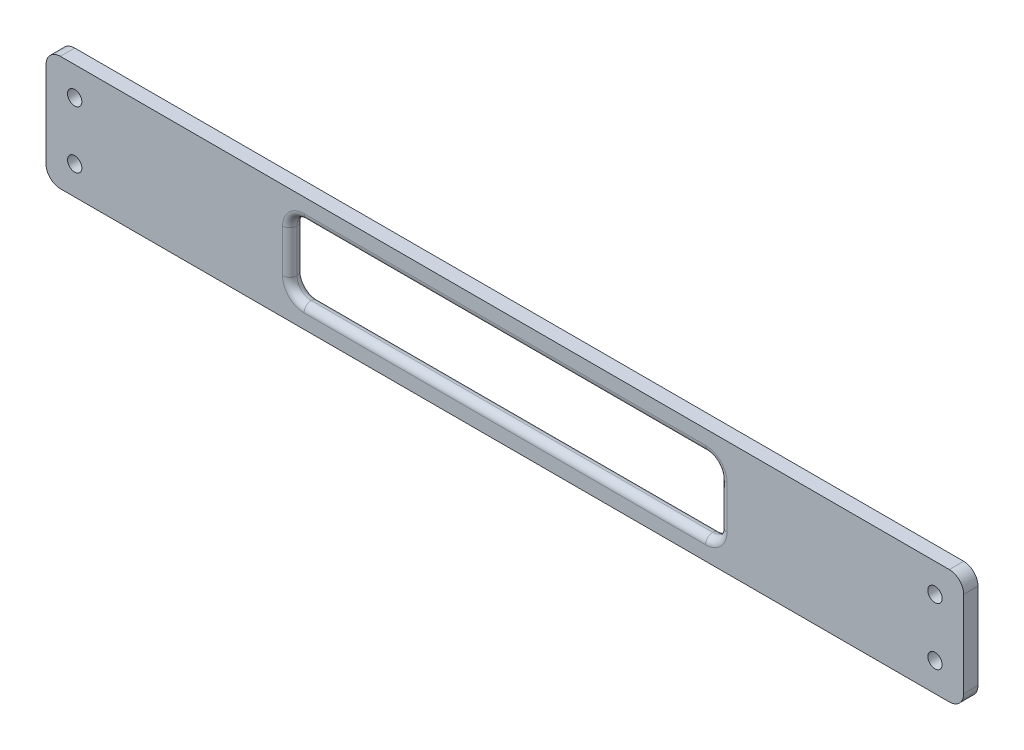
ISO-10303-21;
HEADER;
FILE_DESCRIPTION(('STEP AP214'),'2;1');
FILE_NAME('part.step','',(''),(''),'','','');
FILE_SCHEMA(('AUTOMOTIVE_DESIGN { 1 0 10303 214 1 1 1 1 }'));
ENDSEC;
DATA;
#1=APPLICATION_CONTEXT('core data for automotive mechanical design processes');
#2=APPLICATION_PROTOCOL_DEFINITION('international standard','automotive_design',2000,#1);
#3=PRODUCT_CONTEXT('',#1,'mechanical');
#4=PRODUCT('Part','Part','',(#3));
#5=PRODUCT_RELATED_PRODUCT_CATEGORY('part','',(#4));
#6=PRODUCT_DEFINITION_FORMATION('','',#4);
#7=PRODUCT_DEFINITION_CONTEXT('part definition',#1,'design');
#8=PRODUCT_DEFINITION('design','',#6,#7);
#9=PRODUCT_DEFINITION_SHAPE('','',#8);
#10=(LENGTH_UNIT() NAMED_UNIT(*) SI_UNIT(.MILLI.,.METRE.));
#11=(NAMED_UNIT(*) PLANE_ANGLE_UNIT() SI_UNIT($,.RADIAN.));
#12=(NAMED_UNIT(*) SI_UNIT($,.STERADIAN.) SOLID_ANGLE_UNIT());
#13=UNCERTAINTY_MEASURE_WITH_UNIT(LENGTH_MEASURE(1.E-05),#10,'distance_accuracy_value','');
#14=(GEOMETRIC_REPRESENTATION_CONTEXT(3) GLOBAL_UNCERTAINTY_ASSIGNED_CONTEXT((#13)) GLOBAL_UNIT_ASSIGNED_CONTEXT((#10,
#11,#12)) REPRESENTATION_CONTEXT('',''));
#15=CARTESIAN_POINT('',(0.,0.,0.));
#16=DIRECTION('',(0.,0.,1.));
#17=DIRECTION('',(1.,0.,0.));
#18=AXIS2_PLACEMENT_3D('',#15,#16,#17);
#19=CARTESIAN_POINT('',(203.2,-25.4,6.35));
#20=DIRECTION('',(-1.,0.,0.));
#21=DIRECTION('',(0.,0.,1.));
#22=AXIS2_PLACEMENT_3D('',#19,#20,#21);
#23=PLANE('',#22);
#24=DIRECTION('',(0.,1.,0.));
#25=VECTOR('',#24,1.);
#26=CARTESIAN_POINT('',(203.2,-25.4,6.35));
#27=LINE('',#26,#25);
#28=CARTESIAN_POINT('',(203.2,-19.05,6.35));
#29=VERTEX_POINT('',#28);
#30=CARTESIAN_POINT('',(203.2,19.05,6.35));
#31=VERTEX_POINT('',#30);
#32=EDGE_CURVE('E230',#29,#31,#27,.T.);
#33=ORIENTED_EDGE('',*,*,#32,.F.);
#34=DIRECTION('',(0.,0.,-1.));
#35=VECTOR('',#34,1.);
#36=CARTESIAN_POINT('',(203.2,-19.05,6.35));
#37=LINE('',#36,#35);
#38=CARTESIAN_POINT('',(203.2,-19.05,0.));
#39=VERTEX_POINT('',#38);
#40=EDGE_CURVE('E255',#29,#39,#37,.T.);
#41=ORIENTED_EDGE('',*,*,#40,.T.);
#42=DIRECTION('',(0.,1.,0.));
#43=VECTOR('',#42,1.);
#44=CARTESIAN_POINT('',(203.2,-25.4,0.));
#45=LINE('',#44,#43);
#46=CARTESIAN_POINT('',(203.2,19.05,0.));
#47=VERTEX_POINT('',#46);
#48=EDGE_CURVE('E225',#39,#47,#45,.T.);
#49=ORIENTED_EDGE('',*,*,#48,.T.);
#50=DIRECTION('',(0.,0.,-1.));
#51=VECTOR('',#50,1.);
#52=CARTESIAN_POINT('',(203.2,19.05,6.35));
#53=LINE('',#52,#51);
#54=EDGE_CURVE('E243',#47,#31,#53,.F.);
#55=ORIENTED_EDGE('',*,*,#54,.T.);
#56=EDGE_LOOP('',(#33,#41,#49,#55));
#57=FACE_BOUND('',#56,.T.);
#58=ADVANCED_FACE('F33',(#57),#23,.F.);
#59=CARTESIAN_POINT('',(-203.2,25.4,6.35));
#60=DIRECTION('',(0.,-1.,0.));
#61=DIRECTION('',(0.,0.,-1.));
#62=AXIS2_PLACEMENT_3D('',#59,#60,#61);
#63=PLANE('',#62);
#64=DIRECTION('',(-1.,0.,0.));
#65=VECTOR('',#64,1.);
#66=CARTESIAN_POINT('',(-203.2,25.4,6.35));
#67=LINE('',#66,#65);
#68=CARTESIAN_POINT('',(196.85,25.4,6.35));
#69=VERTEX_POINT('',#68);
#70=CARTESIAN_POINT('',(-196.85,25.4,6.35));
#71=VERTEX_POINT('',#70);
#72=EDGE_CURVE('E233',#69,#71,#67,.T.);
#73=ORIENTED_EDGE('',*,*,#72,.F.);
#74=DIRECTION('',(0.,0.,-1.));
#75=VECTOR('',#74,1.);
#76=CARTESIAN_POINT('',(196.85,25.4,6.35));
#77=LINE('',#76,#75);
#78=CARTESIAN_POINT('',(196.85,25.4,0.));
#79=VERTEX_POINT('',#78);
#80=EDGE_CURVE('E279',#69,#79,#77,.T.);
#81=ORIENTED_EDGE('',*,*,#80,.T.);
#82=DIRECTION('',(-1.,0.,0.));
#83=VECTOR('',#82,1.);
#84=CARTESIAN_POINT('',(-203.2,25.4,0.));
#85=LINE('',#84,#83);
#86=CARTESIAN_POINT('',(-196.85,25.4,0.));
#87=VERTEX_POINT('',#86);
#88=EDGE_CURVE('E246',#79,#87,#85,.T.);
#89=ORIENTED_EDGE('',*,*,#88,.T.);
#90=DIRECTION('',(0.,0.,-1.));
#91=VECTOR('',#90,1.);
#92=CARTESIAN_POINT('',(-196.85,25.4,6.35));
#93=LINE('',#92,#91);
#94=EDGE_CURVE('E277',#87,#71,#93,.F.);
#95=ORIENTED_EDGE('',*,*,#94,.T.);
#96=EDGE_LOOP('',(#73,#81,#89,#95));
#97=FACE_BOUND('',#96,.T.);
#98=ADVANCED_FACE('F389',(#97),#63,.F.);
#99=CARTESIAN_POINT('',(-203.2,-25.4,6.35));
#100=DIRECTION('',(1.,0.,0.));
#101=DIRECTION('',(0.,0.,-1.));
#102=AXIS2_PLACEMENT_3D('',#99,#100,#101);
#103=PLANE('',#102);
#104=DIRECTION('',(0.,-1.,0.));
#105=VECTOR('',#104,1.);
#106=CARTESIAN_POINT('',(-203.2,-25.4,0.));
#107=LINE('',#106,#105);
#108=CARTESIAN_POINT('',(-203.2,19.05,0.));
#109=VERTEX_POINT('',#108);
#110=CARTESIAN_POINT('',(-203.2,-19.05,0.));
#111=VERTEX_POINT('',#110);
#112=EDGE_CURVE('E249',#109,#111,#107,.T.);
#113=ORIENTED_EDGE('',*,*,#112,.T.);
#114=DIRECTION('',(0.,0.,-1.));
#115=VECTOR('',#114,1.);
#116=CARTESIAN_POINT('',(-203.2,-19.05,6.35));
#117=LINE('',#116,#115);
#118=CARTESIAN_POINT('',(-203.2,-19.05,6.35));
#119=VERTEX_POINT('',#118);
#120=EDGE_CURVE('E285',#111,#119,#117,.F.);
#121=ORIENTED_EDGE('',*,*,#120,.T.);
#122=DIRECTION('',(0.,-1.,0.));
#123=VECTOR('',#122,1.);
#124=CARTESIAN_POINT('',(-203.2,-25.4,6.35));
#125=LINE('',#124,#123);
#126=CARTESIAN_POINT('',(-203.2,19.05,6.35));
#127=VERTEX_POINT('',#126);
#128=EDGE_CURVE('E237',#127,#119,#125,.T.);
#129=ORIENTED_EDGE('',*,*,#128,.F.);
#130=DIRECTION('',(0.,0.,-1.));
#131=VECTOR('',#130,1.);
#132=CARTESIAN_POINT('',(-203.2,19.05,6.35));
#133=LINE('',#132,#131);
#134=EDGE_CURVE('E282',#127,#109,#133,.T.);
#135=ORIENTED_EDGE('',*,*,#134,.T.);
#136=EDGE_LOOP('',(#113,#121,#129,#135));
#137=FACE_BOUND('',#136,.T.);
#138=ADVANCED_FACE('F395',(#137),#103,.F.);
#139=CARTESIAN_POINT('',(-203.2,-25.4,6.35));
#140=DIRECTION('',(0.,1.,0.));
#141=DIRECTION('',(0.,0.,1.));
#142=AXIS2_PLACEMENT_3D('',#139,#140,#141);
#143=PLANE('',#142);
#144=DIRECTION('',(1.,0.,0.));
#145=VECTOR('',#144,1.);
#146=CARTESIAN_POINT('',(-203.2,-25.4,0.));
#147=LINE('',#146,#145);
#148=CARTESIAN_POINT('',(-196.85,-25.4,0.));
#149=VERTEX_POINT('',#148);
#150=CARTESIAN_POINT('',(196.85,-25.4,0.));
#151=VERTEX_POINT('',#150);
#152=EDGE_CURVE('E234',#149,#151,#147,.T.);
#153=ORIENTED_EDGE('',*,*,#152,.T.);
#154=DIRECTION('',(0.,0.,-1.));
#155=VECTOR('',#154,1.);
#156=CARTESIAN_POINT('',(196.85,-25.4,6.35));
#157=LINE('',#156,#155);
#158=CARTESIAN_POINT('',(196.85,-25.4,6.35));
#159=VERTEX_POINT('',#158);
#160=EDGE_CURVE('E267',#151,#159,#157,.F.);
#161=ORIENTED_EDGE('',*,*,#160,.T.);
#162=DIRECTION('',(1.,0.,0.));
#163=VECTOR('',#162,1.);
#164=CARTESIAN_POINT('',(-203.2,-25.4,6.35));
#165=LINE('',#164,#163);
#166=CARTESIAN_POINT('',(-196.85,-25.4,6.35));
#167=VERTEX_POINT('',#166);
#168=EDGE_CURVE('E240',#167,#159,#165,.T.);
#169=ORIENTED_EDGE('',*,*,#168,.F.);
#170=DIRECTION('',(0.,0.,-1.));
#171=VECTOR('',#170,1.);
#172=CARTESIAN_POINT('',(-196.85,-25.4,6.35));
#173=LINE('',#172,#171);
#174=EDGE_CURVE('E264',#167,#149,#173,.T.);
#175=ORIENTED_EDGE('',*,*,#174,.T.);
#176=EDGE_LOOP('',(#153,#161,#169,#175));
#177=FACE_BOUND('',#176,.T.);
#178=ADVANCED_FACE('F618',(#177),#143,.F.);
#179=CARTESIAN_POINT('',(0.,0.,6.35));
#180=DIRECTION('',(0.,0.,-1.));
#181=DIRECTION('',(-1.,0.,0.));
#182=AXIS2_PLACEMENT_3D('',#179,#180,#181);
#183=PLANE('',#182);
#184=DIRECTION('',(1.,0.,0.));
#185=VECTOR('',#184,1.);
#186=CARTESIAN_POINT('',(0.,-19.05,6.35));
#187=LINE('',#186,#185);
#188=CARTESIAN_POINT('',(88.9000000000001,-19.05,6.35));
#189=VERTEX_POINT('',#188);
#190=CARTESIAN_POINT('',(-88.9,-19.05,6.35));
#191=VERTEX_POINT('',#190);
#192=EDGE_CURVE('E304',#189,#191,#187,.F.);
#193=ORIENTED_EDGE('',*,*,#192,.T.);
#194=CARTESIAN_POINT('',(-88.9,-9.525,6.35));
#195=DIRECTION('',(0.,0.,-1.));
#196=DIRECTION('',(-1.,0.,0.));
#197=AXIS2_PLACEMENT_3D('',#194,#195,#196);
#198=CIRCLE('',#197,9.525);
#199=CARTESIAN_POINT('',(-98.425,-9.525,6.35));
#200=VERTEX_POINT('',#199);
#201=EDGE_CURVE('E11',#191,#200,#198,.T.);
#202=ORIENTED_EDGE('',*,*,#201,.T.);
#203=DIRECTION('',(0.,-1.,0.));
#204=VECTOR('',#203,1.);
#205=CARTESIAN_POINT('',(-98.425,0.,6.35));
#206=LINE('',#205,#204);
#207=CARTESIAN_POINT('',(-98.425,9.525,6.35));
#208=VERTEX_POINT('',#207);
#209=EDGE_CURVE('E43',#200,#208,#206,.F.);
#210=ORIENTED_EDGE('',*,*,#209,.T.);
#211=CARTESIAN_POINT('',(-88.9,9.525,6.35));
#212=DIRECTION('',(0.,0.,-1.));
#213=DIRECTION('',(-1.,0.,0.));
#214=AXIS2_PLACEMENT_3D('',#211,#212,#213);
#215=CIRCLE('',#214,9.525);
#216=CARTESIAN_POINT('',(-88.9,19.05,6.35));
#217=VERTEX_POINT('',#216);
#218=EDGE_CURVE('E180',#208,#217,#215,.T.);
#219=ORIENTED_EDGE('',*,*,#218,.T.);
#220=DIRECTION('',(-1.,0.,0.));
#221=VECTOR('',#220,1.);
#222=CARTESIAN_POINT('',(0.,19.05,6.35));
#223=LINE('',#222,#221);
#224=CARTESIAN_POINT('',(88.9000000000001,19.05,6.35));
#225=VERTEX_POINT('',#224);
#226=EDGE_CURVE('E184',#217,#225,#223,.F.);
#227=ORIENTED_EDGE('',*,*,#226,.T.);
#228=CARTESIAN_POINT('',(88.9000000000001,9.525,6.35));
#229=DIRECTION('',(0.,0.,-1.));
#230=DIRECTION('',(-1.,0.,0.));
#231=AXIS2_PLACEMENT_3D('',#228,#229,#230);
#232=CIRCLE('',#231,9.52499999999999);
#233=CARTESIAN_POINT('',(98.425,9.525,6.35));
#234=VERTEX_POINT('',#233);
#235=EDGE_CURVE('E194',#225,#234,#232,.T.);
#236=ORIENTED_EDGE('',*,*,#235,.T.);
#237=DIRECTION('',(0.,1.,0.));
#238=VECTOR('',#237,1.);
#239=CARTESIAN_POINT('',(98.425,0.,6.35));
#240=LINE('',#239,#238);
#241=CARTESIAN_POINT('',(98.4250000000001,-9.525,6.35));
#242=VERTEX_POINT('',#241);
#243=EDGE_CURVE('E308',#234,#242,#240,.F.);
#244=ORIENTED_EDGE('',*,*,#243,.T.);
#245=CARTESIAN_POINT('',(88.9000000000001,-9.525,6.35));
#246=DIRECTION('',(0.,0.,-1.));
#247=DIRECTION('',(-1.,0.,0.));
#248=AXIS2_PLACEMENT_3D('',#245,#246,#247);
#249=CIRCLE('',#248,9.52499999999999);
#250=EDGE_CURVE('E306',#242,#189,#249,.T.);
#251=ORIENTED_EDGE('',*,*,#250,.T.);
#252=EDGE_LOOP('',(#193,#202,#210,#219,#227,#236,#244,#251));
#253=FACE_BOUND('',#252,.T.);
#254=CARTESIAN_POINT('',(190.5,12.7,6.35));
#255=DIRECTION('',(0.,0.,1.));
#256=DIRECTION('',(-1.,0.,0.));
#257=AXIS2_PLACEMENT_3D('',#254,#255,#256);
#258=CIRCLE('',#257,3.175);
#259=CARTESIAN_POINT('',(187.325,12.7,6.35));
#260=VERTEX_POINT('',#259);
#261=EDGE_CURVE('E211',#260,#260,#258,.T.);
#262=ORIENTED_EDGE('',*,*,#261,.F.);
#263=EDGE_LOOP('',(#262));
#264=FACE_BOUND('',#263,.T.);
#265=CARTESIAN_POINT('',(190.5,-12.7,6.35));
#266=DIRECTION('',(0.,0.,1.));
#267=DIRECTION('',(-1.,0.,0.));
#268=AXIS2_PLACEMENT_3D('',#265,#266,#267);
#269=CIRCLE('',#268,3.175);
#270=CARTESIAN_POINT('',(187.325,-12.7,6.35));
#271=VERTEX_POINT('',#270);
#272=EDGE_CURVE('E218',#271,#271,#269,.T.);
#273=ORIENTED_EDGE('',*,*,#272,.F.);
#274=EDGE_LOOP('',(#273));
#275=FACE_BOUND('',#274,.T.);
#276=CARTESIAN_POINT('',(-190.5,-12.7,6.35));
#277=DIRECTION('',(0.,0.,1.));
#278=DIRECTION('',(1.,0.,0.));
#279=AXIS2_PLACEMENT_3D('',#276,#277,#278);
#280=CIRCLE('',#279,3.175);
#281=CARTESIAN_POINT('',(-187.325,-12.7,6.35));
#282=VERTEX_POINT('',#281);
#283=EDGE_CURVE('E691',#282,#282,#280,.T.);
#284=ORIENTED_EDGE('',*,*,#283,.F.);
#285=EDGE_LOOP('',(#284));
#286=FACE_BOUND('',#285,.T.);
#287=CARTESIAN_POINT('',(-190.5,12.7,6.35));
#288=DIRECTION('',(0.,0.,1.));
#289=DIRECTION('',(1.,0.,0.));
#290=AXIS2_PLACEMENT_3D('',#287,#288,#289);
#291=CIRCLE('',#290,3.175);
#292=CARTESIAN_POINT('',(-187.325,12.7,6.35));
#293=VERTEX_POINT('',#292);
#294=EDGE_CURVE('E226',#293,#293,#291,.T.);
#295=ORIENTED_EDGE('',*,*,#294,.F.);
#296=EDGE_LOOP('',(#295));
#297=FACE_BOUND('',#296,.T.);
#298=ORIENTED_EDGE('',*,*,#168,.T.);
#299=CARTESIAN_POINT('',(196.85,-19.05,6.35));
#300=DIRECTION('',(0.,0.,-1.));
#301=DIRECTION('',(-1.,0.,0.));
#302=AXIS2_PLACEMENT_3D('',#299,#300,#301);
#303=CIRCLE('',#302,6.35);
#304=EDGE_CURVE('E275',#159,#29,#303,.F.);
#305=ORIENTED_EDGE('',*,*,#304,.T.);
#306=ORIENTED_EDGE('',*,*,#32,.T.);
#307=CARTESIAN_POINT('',(196.85,19.05,6.35));
#308=DIRECTION('',(0.,0.,-1.));
#309=DIRECTION('',(-1.,0.,0.));
#310=AXIS2_PLACEMENT_3D('',#307,#308,#309);
#311=CIRCLE('',#310,6.35);
#312=EDGE_CURVE('E273',#31,#69,#311,.F.);
#313=ORIENTED_EDGE('',*,*,#312,.T.);
#314=ORIENTED_EDGE('',*,*,#72,.T.);
#315=CARTESIAN_POINT('',(-196.85,19.05,6.35));
#316=DIRECTION('',(0.,0.,-1.));
#317=DIRECTION('',(-1.,0.,0.));
#318=AXIS2_PLACEMENT_3D('',#315,#316,#317);
#319=CIRCLE('',#318,6.35);
#320=EDGE_CURVE('E269',#71,#127,#319,.F.);
#321=ORIENTED_EDGE('',*,*,#320,.T.);
#322=ORIENTED_EDGE('',*,*,#128,.T.);
#323=CARTESIAN_POINT('',(-196.85,-19.05,6.35));
#324=DIRECTION('',(0.,0.,-1.));
#325=DIRECTION('',(-1.,0.,0.));
#326=AXIS2_PLACEMENT_3D('',#323,#324,#325);
#327=CIRCLE('',#326,6.35);
#328=EDGE_CURVE('E271',#119,#167,#327,.F.);
#329=ORIENTED_EDGE('',*,*,#328,.T.);
#330=EDGE_LOOP('',(#298,#305,#306,#313,#314,#321,#322,#329));
#331=FACE_BOUND('',#330,.T.);
#332=ADVANCED_FACE('F182',(#253,#264,#275,#286,#297,#331),#183,.F.);
#333=CARTESIAN_POINT('',(0.,0.,0.));
#334=DIRECTION('',(0.,0.,-1.));
#335=DIRECTION('',(-1.,0.,0.));
#336=AXIS2_PLACEMENT_3D('',#333,#334,#335);
#337=PLANE('',#336);
#338=DIRECTION('',(0.,-1.,0.));
#339=VECTOR('',#338,1.);
#340=CARTESIAN_POINT('',(-98.425,-9.525,0.));
#341=LINE('',#340,#339);
#342=CARTESIAN_POINT('',(-98.425,9.525,0.));
#343=VERTEX_POINT('',#342);
#344=CARTESIAN_POINT('',(-98.425,-9.525,0.));
#345=VERTEX_POINT('',#344);
#346=EDGE_CURVE('E299',#343,#345,#341,.T.);
#347=ORIENTED_EDGE('',*,*,#346,.T.);
#348=CARTESIAN_POINT('',(-88.9,-9.525,0.));
#349=DIRECTION('',(0.,0.,-1.));
#350=DIRECTION('',(-1.,0.,0.));
#351=AXIS2_PLACEMENT_3D('',#348,#349,#350);
#352=CIRCLE('',#351,9.525);
#353=CARTESIAN_POINT('',(-88.9,-19.05,0.));
#354=VERTEX_POINT('',#353);
#355=EDGE_CURVE('E301',#345,#354,#352,.F.);
#356=ORIENTED_EDGE('',*,*,#355,.T.);
#357=DIRECTION('',(1.,0.,0.));
#358=VECTOR('',#357,1.);
#359=CARTESIAN_POINT('',(88.9000000000001,-19.05,0.));
#360=LINE('',#359,#358);
#361=CARTESIAN_POINT('',(88.9000000000001,-19.05,0.));
#362=VERTEX_POINT('',#361);
#363=EDGE_CURVE('E287',#354,#362,#360,.T.);
#364=ORIENTED_EDGE('',*,*,#363,.T.);
#365=CARTESIAN_POINT('',(88.9000000000001,-9.525,0.));
#366=DIRECTION('',(0.,0.,-1.));
#367=DIRECTION('',(-1.,0.,0.));
#368=AXIS2_PLACEMENT_3D('',#365,#366,#367);
#369=CIRCLE('',#368,9.52499999999999);
#370=CARTESIAN_POINT('',(98.4250000000001,-9.525,0.));
#371=VERTEX_POINT('',#370);
#372=EDGE_CURVE('E289',#362,#371,#369,.F.);
#373=ORIENTED_EDGE('',*,*,#372,.T.);
#374=DIRECTION('',(0.,1.,0.));
#375=VECTOR('',#374,1.);
#376=CARTESIAN_POINT('',(98.425,9.525,0.));
#377=LINE('',#376,#375);
#378=CARTESIAN_POINT('',(98.425,9.525,0.));
#379=VERTEX_POINT('',#378);
#380=EDGE_CURVE('E291',#371,#379,#377,.T.);
#381=ORIENTED_EDGE('',*,*,#380,.T.);
#382=CARTESIAN_POINT('',(88.9000000000001,9.525,0.));
#383=DIRECTION('',(0.,0.,-1.));
#384=DIRECTION('',(-1.,0.,0.));
#385=AXIS2_PLACEMENT_3D('',#382,#383,#384);
#386=CIRCLE('',#385,9.52499999999999);
#387=CARTESIAN_POINT('',(88.9000000000001,19.05,0.));
#388=VERTEX_POINT('',#387);
#389=EDGE_CURVE('E293',#379,#388,#386,.F.);
#390=ORIENTED_EDGE('',*,*,#389,.T.);
#391=DIRECTION('',(-1.,0.,0.));
#392=VECTOR('',#391,1.);
#393=CARTESIAN_POINT('',(-88.9,19.05,0.));
#394=LINE('',#393,#392);
#395=CARTESIAN_POINT('',(-88.9,19.05,0.));
#396=VERTEX_POINT('',#395);
#397=EDGE_CURVE('E295',#388,#396,#394,.T.);
#398=ORIENTED_EDGE('',*,*,#397,.T.);
#399=CARTESIAN_POINT('',(-88.9,9.525,0.));
#400=DIRECTION('',(0.,0.,-1.));
#401=DIRECTION('',(-1.,0.,0.));
#402=AXIS2_PLACEMENT_3D('',#399,#400,#401);
#403=CIRCLE('',#402,9.525);
#404=EDGE_CURVE('E297',#396,#343,#403,.F.);
#405=ORIENTED_EDGE('',*,*,#404,.T.);
#406=EDGE_LOOP('',(#347,#356,#364,#373,#381,#390,#398,#405));
#407=FACE_BOUND('',#406,.T.);
#408=CARTESIAN_POINT('',(190.5,12.7,0.));
#409=DIRECTION('',(0.,0.,1.));
#410=DIRECTION('',(-1.,0.,0.));
#411=AXIS2_PLACEMENT_3D('',#408,#409,#410);
#412=CIRCLE('',#411,3.175);
#413=CARTESIAN_POINT('',(187.325,12.7,0.));
#414=VERTEX_POINT('',#413);
#415=EDGE_CURVE('E213',#414,#414,#412,.T.);
#416=ORIENTED_EDGE('',*,*,#415,.T.);
#417=EDGE_LOOP('',(#416));
#418=FACE_BOUND('',#417,.T.);
#419=CARTESIAN_POINT('',(190.5,-12.7,0.));
#420=DIRECTION('',(0.,0.,1.));
#421=DIRECTION('',(-1.,0.,0.));
#422=AXIS2_PLACEMENT_3D('',#419,#420,#421);
#423=CIRCLE('',#422,3.175);
#424=CARTESIAN_POINT('',(187.325,-12.7,0.));
#425=VERTEX_POINT('',#424);
#426=EDGE_CURVE('E683',#425,#425,#423,.T.);
#427=ORIENTED_EDGE('',*,*,#426,.T.);
#428=EDGE_LOOP('',(#427));
#429=FACE_BOUND('',#428,.T.);
#430=CARTESIAN_POINT('',(-190.5,-12.7,0.));
#431=DIRECTION('',(0.,0.,1.));
#432=DIRECTION('',(1.,0.,0.));
#433=AXIS2_PLACEMENT_3D('',#430,#431,#432);
#434=CIRCLE('',#433,3.175);
#435=CARTESIAN_POINT('',(-187.325,-12.7,0.));
#436=VERTEX_POINT('',#435);
#437=EDGE_CURVE('E229',#436,#436,#434,.T.);
#438=ORIENTED_EDGE('',*,*,#437,.T.);
#439=EDGE_LOOP('',(#438));
#440=FACE_BOUND('',#439,.T.);
#441=CARTESIAN_POINT('',(-190.5,12.7,0.));
#442=DIRECTION('',(0.,0.,1.));
#443=DIRECTION('',(1.,0.,0.));
#444=AXIS2_PLACEMENT_3D('',#441,#442,#443);
#445=CIRCLE('',#444,3.175);
#446=CARTESIAN_POINT('',(-187.325,12.7,0.));
#447=VERTEX_POINT('',#446);
#448=EDGE_CURVE('E222',#447,#447,#445,.T.);
#449=ORIENTED_EDGE('',*,*,#448,.T.);
#450=EDGE_LOOP('',(#449));
#451=FACE_BOUND('',#450,.T.);
#452=ORIENTED_EDGE('',*,*,#48,.F.);
#453=CARTESIAN_POINT('',(196.85,-19.05,0.));
#454=DIRECTION('',(0.,0.,-1.));
#455=DIRECTION('',(-1.,0.,0.));
#456=AXIS2_PLACEMENT_3D('',#453,#454,#455);
#457=CIRCLE('',#456,6.35);
#458=EDGE_CURVE('E93',#39,#151,#457,.T.);
#459=ORIENTED_EDGE('',*,*,#458,.T.);
#460=ORIENTED_EDGE('',*,*,#152,.F.);
#461=CARTESIAN_POINT('',(-196.85,-19.05,0.));
#462=DIRECTION('',(0.,0.,-1.));
#463=DIRECTION('',(-1.,0.,0.));
#464=AXIS2_PLACEMENT_3D('',#461,#462,#463);
#465=CIRCLE('',#464,6.35);
#466=EDGE_CURVE('E259',#149,#111,#465,.T.);
#467=ORIENTED_EDGE('',*,*,#466,.T.);
#468=ORIENTED_EDGE('',*,*,#112,.F.);
#469=CARTESIAN_POINT('',(-196.85,19.05,0.));
#470=DIRECTION('',(0.,0.,-1.));
#471=DIRECTION('',(-1.,0.,0.));
#472=AXIS2_PLACEMENT_3D('',#469,#470,#471);
#473=CIRCLE('',#472,6.35);
#474=EDGE_CURVE('E257',#109,#87,#473,.T.);
#475=ORIENTED_EDGE('',*,*,#474,.T.);
#476=ORIENTED_EDGE('',*,*,#88,.F.);
#477=CARTESIAN_POINT('',(196.85,19.05,0.));
#478=DIRECTION('',(0.,0.,-1.));
#479=DIRECTION('',(-1.,0.,0.));
#480=AXIS2_PLACEMENT_3D('',#477,#478,#479);
#481=CIRCLE('',#480,6.35);
#482=EDGE_CURVE('E261',#79,#47,#481,.T.);
#483=ORIENTED_EDGE('',*,*,#482,.T.);
#484=EDGE_LOOP('',(#452,#459,#460,#467,#468,#475,#476,#483));
#485=FACE_BOUND('',#484,.T.);
#486=ADVANCED_FACE('F405',(#407,#418,#429,#440,#451,#485),#337,.T.);
#487=CARTESIAN_POINT('',(196.85,-19.05,6.35));
#488=DIRECTION('',(0.,0.,-1.));
#489=DIRECTION('',(-1.,0.,0.));
#490=AXIS2_PLACEMENT_3D('',#487,#488,#489);
#491=CYLINDRICAL_SURFACE('',#490,6.35);
#492=ORIENTED_EDGE('',*,*,#304,.F.);
#493=ORIENTED_EDGE('',*,*,#160,.F.);
#494=ORIENTED_EDGE('',*,*,#458,.F.);
#495=ORIENTED_EDGE('',*,*,#40,.F.);
#496=EDGE_LOOP('',(#492,#493,#494,#495));
#497=FACE_BOUND('',#496,.T.);
#498=ADVANCED_FACE('F401',(#497),#491,.T.);
#499=CARTESIAN_POINT('',(196.85,19.05,6.35));
#500=DIRECTION('',(0.,0.,-1.));
#501=DIRECTION('',(-1.,0.,0.));
#502=AXIS2_PLACEMENT_3D('',#499,#500,#501);
#503=CYLINDRICAL_SURFACE('',#502,6.35);
#504=ORIENTED_EDGE('',*,*,#312,.F.);
#505=ORIENTED_EDGE('',*,*,#54,.F.);
#506=ORIENTED_EDGE('',*,*,#482,.F.);
#507=ORIENTED_EDGE('',*,*,#80,.F.);
#508=EDGE_LOOP('',(#504,#505,#506,#507));
#509=FACE_BOUND('',#508,.T.);
#510=ADVANCED_FACE('F404',(#509),#503,.T.);
#511=CARTESIAN_POINT('',(-196.85,-19.05,6.35));
#512=DIRECTION('',(0.,0.,-1.));
#513=DIRECTION('',(-1.,0.,0.));
#514=AXIS2_PLACEMENT_3D('',#511,#512,#513);
#515=CYLINDRICAL_SURFACE('',#514,6.35);
#516=ORIENTED_EDGE('',*,*,#328,.F.);
#517=ORIENTED_EDGE('',*,*,#120,.F.);
#518=ORIENTED_EDGE('',*,*,#466,.F.);
#519=ORIENTED_EDGE('',*,*,#174,.F.);
#520=EDGE_LOOP('',(#516,#517,#518,#519));
#521=FACE_BOUND('',#520,.T.);
#522=ADVANCED_FACE('F408',(#521),#515,.T.);
#523=CARTESIAN_POINT('',(-196.85,19.05,6.35));
#524=DIRECTION('',(0.,0.,-1.));
#525=DIRECTION('',(-1.,0.,0.));
#526=AXIS2_PLACEMENT_3D('',#523,#524,#525);
#527=CYLINDRICAL_SURFACE('',#526,6.35);
#528=ORIENTED_EDGE('',*,*,#320,.F.);
#529=ORIENTED_EDGE('',*,*,#94,.F.);
#530=ORIENTED_EDGE('',*,*,#474,.F.);
#531=ORIENTED_EDGE('',*,*,#134,.F.);
#532=EDGE_LOOP('',(#528,#529,#530,#531));
#533=FACE_BOUND('',#532,.T.);
#534=ADVANCED_FACE('F412',(#533),#527,.T.);
#535=CARTESIAN_POINT('',(-190.5,12.7,0.));
#536=DIRECTION('',(0.,0.,1.));
#537=DIRECTION('',(1.,0.,0.));
#538=AXIS2_PLACEMENT_3D('',#535,#536,#537);
#539=CYLINDRICAL_SURFACE('',#538,3.175);
#540=ORIENTED_EDGE('',*,*,#448,.F.);
#541=EDGE_LOOP('',(#540));
#542=FACE_BOUND('',#541,.T.);
#543=ORIENTED_EDGE('',*,*,#294,.T.);
#544=EDGE_LOOP('',(#543));
#545=FACE_BOUND('',#544,.T.);
#546=ADVANCED_FACE('F416',(#542,#545),#539,.F.);
#547=CARTESIAN_POINT('',(-190.5,-12.7,0.));
#548=DIRECTION('',(0.,0.,1.));
#549=DIRECTION('',(1.,0.,0.));
#550=AXIS2_PLACEMENT_3D('',#547,#548,#549);
#551=CYLINDRICAL_SURFACE('',#550,3.175);
#552=ORIENTED_EDGE('',*,*,#437,.F.);
#553=EDGE_LOOP('',(#552));
#554=FACE_BOUND('',#553,.T.);
#555=ORIENTED_EDGE('',*,*,#283,.T.);
#556=EDGE_LOOP('',(#555));
#557=FACE_BOUND('',#556,.T.);
#558=ADVANCED_FACE('F567',(#554,#557),#551,.F.);
#559=CARTESIAN_POINT('',(190.5,-12.7,0.));
#560=DIRECTION('',(0.,0.,1.));
#561=DIRECTION('',(1.,0.,0.));
#562=AXIS2_PLACEMENT_3D('',#559,#560,#561);
#563=CYLINDRICAL_SURFACE('',#562,3.175);
#564=ORIENTED_EDGE('',*,*,#426,.F.);
#565=EDGE_LOOP('',(#564));
#566=FACE_BOUND('',#565,.T.);
#567=ORIENTED_EDGE('',*,*,#272,.T.);
#568=EDGE_LOOP('',(#567));
#569=FACE_BOUND('',#568,.T.);
#570=ADVANCED_FACE('F385',(#566,#569),#563,.F.);
#571=CARTESIAN_POINT('',(190.5,12.7,0.));
#572=DIRECTION('',(0.,0.,1.));
#573=DIRECTION('',(1.,0.,0.));
#574=AXIS2_PLACEMENT_3D('',#571,#572,#573);
#575=CYLINDRICAL_SURFACE('',#574,3.175);
#576=ORIENTED_EDGE('',*,*,#415,.F.);
#577=EDGE_LOOP('',(#576));
#578=FACE_BOUND('',#577,.T.);
#579=ORIENTED_EDGE('',*,*,#261,.T.);
#580=EDGE_LOOP('',(#579));
#581=FACE_BOUND('',#580,.T.);
#582=ADVANCED_FACE('F380',(#578,#581),#575,.F.);
#583=CARTESIAN_POINT('',(88.9000000000001,9.525,3.175));
#584=DIRECTION('',(0.,0.,-1.));
#585=DIRECTION('',(-1.,0.,0.));
#586=AXIS2_PLACEMENT_3D('',#583,#584,#585);
#587=TOROIDAL_SURFACE('',#586,9.52499999999999,3.175);
#588=CARTESIAN_POINT('',(98.4250000000001,9.525,3.175));
#589=DIRECTION('',(0.,-1.,0.));
#590=DIRECTION('',(0.,0.,-1.));
#591=AXIS2_PLACEMENT_3D('',#588,#589,#590);
#592=CIRCLE('',#591,3.175);
#593=CARTESIAN_POINT('',(95.25,9.525,3.175));
#594=VERTEX_POINT('',#593);
#595=EDGE_CURVE('E201',#234,#594,#592,.T.);
#596=ORIENTED_EDGE('',*,*,#595,.F.);
#597=ORIENTED_EDGE('',*,*,#235,.F.);
#598=CARTESIAN_POINT('',(88.9000000000001,19.05,3.175));
#599=DIRECTION('',(-1.,0.,0.));
#600=DIRECTION('',(0.,0.,1.));
#601=AXIS2_PLACEMENT_3D('',#598,#599,#600);
#602=CIRCLE('',#601,3.175);
#603=CARTESIAN_POINT('',(88.9000000000001,15.875,3.175));
#604=VERTEX_POINT('',#603);
#605=EDGE_CURVE('E37',#604,#225,#602,.T.);
#606=ORIENTED_EDGE('',*,*,#605,.F.);
#607=CARTESIAN_POINT('',(88.9000000000001,9.525,3.175));
#608=DIRECTION('',(0.,0.,-1.));
#609=DIRECTION('',(-1.,0.,0.));
#610=AXIS2_PLACEMENT_3D('',#607,#608,#609);
#611=CIRCLE('',#610,6.34999999999999);
#612=EDGE_CURVE('E81',#594,#604,#611,.F.);
#613=ORIENTED_EDGE('',*,*,#612,.F.);
#614=EDGE_LOOP('',(#596,#597,#606,#613));
#615=FACE_BOUND('',#614,.T.);
#616=ADVANCED_FACE('F35',(#615),#587,.T.);
#617=CARTESIAN_POINT('',(-88.9,19.05,3.175));
#618=DIRECTION('',(-1.,0.,0.));
#619=DIRECTION('',(0.,0.,1.));
#620=AXIS2_PLACEMENT_3D('',#617,#618,#619);
#621=CYLINDRICAL_SURFACE('',#620,3.175);
#622=ORIENTED_EDGE('',*,*,#605,.T.);
#623=ORIENTED_EDGE('',*,*,#226,.F.);
#624=CARTESIAN_POINT('',(-88.9,19.05,3.175));
#625=DIRECTION('',(-1.,0.,0.));
#626=DIRECTION('',(0.,0.,1.));
#627=AXIS2_PLACEMENT_3D('',#624,#625,#626);
#628=CIRCLE('',#627,3.175);
#629=CARTESIAN_POINT('',(-88.9,15.875,3.175));
#630=VERTEX_POINT('',#629);
#631=EDGE_CURVE('E192',#630,#217,#628,.T.);
#632=ORIENTED_EDGE('',*,*,#631,.F.);
#633=DIRECTION('',(-1.,0.,0.));
#634=VECTOR('',#633,1.);
#635=CARTESIAN_POINT('',(-88.9,15.875,3.175));
#636=LINE('',#635,#634);
#637=EDGE_CURVE('E202',#604,#630,#636,.T.);
#638=ORIENTED_EDGE('',*,*,#637,.F.);
#639=EDGE_LOOP('',(#622,#623,#632,#638));
#640=FACE_BOUND('',#639,.T.);
#641=ADVANCED_FACE('F190',(#640),#621,.T.);
#642=CARTESIAN_POINT('',(88.9000000000001,9.525,3.175));
#643=DIRECTION('',(0.,0.,-1.));
#644=DIRECTION('',(-1.,0.,0.));
#645=AXIS2_PLACEMENT_3D('',#642,#643,#644);
#646=TOROIDAL_SURFACE('',#645,9.52499999999999,3.175);
#647=CARTESIAN_POINT('',(98.4250000000001,9.525,3.175));
#648=DIRECTION('',(0.,-1.,0.));
#649=DIRECTION('',(0.,0.,-1.));
#650=AXIS2_PLACEMENT_3D('',#647,#648,#649);
#651=CIRCLE('',#650,3.175);
#652=EDGE_CURVE('E355',#594,#379,#651,.T.);
#653=ORIENTED_EDGE('',*,*,#652,.F.);
#654=ORIENTED_EDGE('',*,*,#612,.T.);
#655=CARTESIAN_POINT('',(88.9000000000001,19.05,3.175));
#656=DIRECTION('',(-1.,0.,0.));
#657=DIRECTION('',(0.,0.,1.));
#658=AXIS2_PLACEMENT_3D('',#655,#656,#657);
#659=CIRCLE('',#658,3.175);
#660=EDGE_CURVE('E205',#388,#604,#659,.T.);
#661=ORIENTED_EDGE('',*,*,#660,.F.);
#662=ORIENTED_EDGE('',*,*,#389,.F.);
#663=EDGE_LOOP('',(#653,#654,#661,#662));
#664=FACE_BOUND('',#663,.T.);
#665=ADVANCED_FACE('F363',(#664),#646,.T.);
#666=CARTESIAN_POINT('',(98.425,-9.525,3.175));
#667=DIRECTION('',(0.,1.,0.));
#668=DIRECTION('',(0.,0.,1.));
#669=AXIS2_PLACEMENT_3D('',#666,#667,#668);
#670=CYLINDRICAL_SURFACE('',#669,3.175);
#671=ORIENTED_EDGE('',*,*,#243,.F.);
#672=ORIENTED_EDGE('',*,*,#595,.T.);
#673=DIRECTION('',(0.,1.,0.));
#674=VECTOR('',#673,1.);
#675=CARTESIAN_POINT('',(95.25,-9.525,3.175));
#676=LINE('',#675,#674);
#677=CARTESIAN_POINT('',(95.2500000000001,-9.525,3.175));
#678=VERTEX_POINT('',#677);
#679=EDGE_CURVE('E352',#678,#594,#676,.T.);
#680=ORIENTED_EDGE('',*,*,#679,.F.);
#681=CARTESIAN_POINT('',(98.425,-9.525,3.175));
#682=DIRECTION('',(0.,-1.,0.));
#683=DIRECTION('',(0.,0.,-1.));
#684=AXIS2_PLACEMENT_3D('',#681,#682,#683);
#685=CIRCLE('',#684,3.175);
#686=EDGE_CURVE('E349',#242,#678,#685,.T.);
#687=ORIENTED_EDGE('',*,*,#686,.F.);
#688=EDGE_LOOP('',(#671,#672,#680,#687));
#689=FACE_BOUND('',#688,.T.);
#690=ADVANCED_FACE('F372',(#689),#670,.T.);
#691=CARTESIAN_POINT('',(-88.9,9.525,3.175));
#692=DIRECTION('',(0.,0.,-1.));
#693=DIRECTION('',(-1.,0.,0.));
#694=AXIS2_PLACEMENT_3D('',#691,#692,#693);
#695=TOROIDAL_SURFACE('',#694,9.525,3.175);
#696=ORIENTED_EDGE('',*,*,#631,.T.);
#697=ORIENTED_EDGE('',*,*,#218,.F.);
#698=CARTESIAN_POINT('',(-98.425,9.525,3.175));
#699=DIRECTION('',(0.,-1.,0.));
#700=DIRECTION('',(0.,0.,-1.));
#701=AXIS2_PLACEMENT_3D('',#698,#699,#700);
#702=CIRCLE('',#701,3.175);
#703=CARTESIAN_POINT('',(-95.25,9.525,3.175));
#704=VERTEX_POINT('',#703);
#705=EDGE_CURVE('E347',#704,#208,#702,.T.);
#706=ORIENTED_EDGE('',*,*,#705,.F.);
#707=CARTESIAN_POINT('',(-88.9,9.525,3.175));
#708=DIRECTION('',(0.,0.,-1.));
#709=DIRECTION('',(-1.,0.,0.));
#710=AXIS2_PLACEMENT_3D('',#707,#708,#709);
#711=CIRCLE('',#710,6.35);
#712=EDGE_CURVE('E199',#630,#704,#711,.F.);
#713=ORIENTED_EDGE('',*,*,#712,.F.);
#714=EDGE_LOOP('',(#696,#697,#706,#713));
#715=FACE_BOUND('',#714,.T.);
#716=ADVANCED_FACE('F197',(#715),#695,.T.);
#717=CARTESIAN_POINT('',(0.,19.05,3.175));
#718=DIRECTION('',(1.,0.,0.));
#719=DIRECTION('',(0.,0.,-1.));
#720=AXIS2_PLACEMENT_3D('',#717,#718,#719);
#721=CYLINDRICAL_SURFACE('',#720,3.175);
#722=ORIENTED_EDGE('',*,*,#660,.T.);
#723=ORIENTED_EDGE('',*,*,#637,.T.);
#724=CARTESIAN_POINT('',(-88.9,19.05,3.175));
#725=DIRECTION('',(-1.,0.,0.));
#726=DIRECTION('',(0.,0.,1.));
#727=AXIS2_PLACEMENT_3D('',#724,#725,#726);
#728=CIRCLE('',#727,3.175);
#729=EDGE_CURVE('E344',#396,#630,#728,.T.);
#730=ORIENTED_EDGE('',*,*,#729,.F.);
#731=ORIENTED_EDGE('',*,*,#397,.F.);
#732=EDGE_LOOP('',(#722,#723,#730,#731));
#733=FACE_BOUND('',#732,.T.);
#734=ADVANCED_FACE('F360',(#733),#721,.T.);
#735=CARTESIAN_POINT('',(98.425,0.,3.175));
#736=DIRECTION('',(0.,-1.,0.));
#737=DIRECTION('',(0.,0.,-1.));
#738=AXIS2_PLACEMENT_3D('',#735,#736,#737);
#739=CYLINDRICAL_SURFACE('',#738,3.175);
#740=ORIENTED_EDGE('',*,*,#652,.T.);
#741=ORIENTED_EDGE('',*,*,#380,.F.);
#742=CARTESIAN_POINT('',(98.425,-9.525,3.175));
#743=DIRECTION('',(0.,-1.,0.));
#744=DIRECTION('',(0.,0.,-1.));
#745=AXIS2_PLACEMENT_3D('',#742,#743,#744);
#746=CIRCLE('',#745,3.175);
#747=EDGE_CURVE('E341',#678,#371,#746,.T.);
#748=ORIENTED_EDGE('',*,*,#747,.F.);
#749=ORIENTED_EDGE('',*,*,#679,.T.);
#750=EDGE_LOOP('',(#740,#741,#748,#749));
#751=FACE_BOUND('',#750,.T.);
#752=ADVANCED_FACE('F367',(#751),#739,.T.);
#753=CARTESIAN_POINT('',(88.9000000000001,-9.525,3.175));
#754=DIRECTION('',(0.,0.,-1.));
#755=DIRECTION('',(-1.,0.,0.));
#756=AXIS2_PLACEMENT_3D('',#753,#754,#755);
#757=TOROIDAL_SURFACE('',#756,9.52499999999999,3.175);
#758=ORIENTED_EDGE('',*,*,#250,.F.);
#759=ORIENTED_EDGE('',*,*,#686,.T.);
#760=CARTESIAN_POINT('',(88.9000000000001,-9.525,3.175));
#761=DIRECTION('',(0.,0.,-1.));
#762=DIRECTION('',(-1.,0.,0.));
#763=AXIS2_PLACEMENT_3D('',#760,#761,#762);
#764=CIRCLE('',#763,6.34999999999999);
#765=CARTESIAN_POINT('',(88.9000000000001,-15.875,3.175));
#766=VERTEX_POINT('',#765);
#767=EDGE_CURVE('E338',#766,#678,#764,.F.);
#768=ORIENTED_EDGE('',*,*,#767,.F.);
#769=CARTESIAN_POINT('',(88.9000000000001,-19.05,3.175));
#770=DIRECTION('',(-1.,0.,0.));
#771=DIRECTION('',(0.,0.,1.));
#772=AXIS2_PLACEMENT_3D('',#769,#770,#771);
#773=CIRCLE('',#772,3.175);
#774=EDGE_CURVE('E335',#189,#766,#773,.T.);
#775=ORIENTED_EDGE('',*,*,#774,.F.);
#776=EDGE_LOOP('',(#758,#759,#768,#775));
#777=FACE_BOUND('',#776,.T.);
#778=ADVANCED_FACE('F375',(#777),#757,.T.);
#779=CARTESIAN_POINT('',(-98.425,-9.525,3.175));
#780=DIRECTION('',(0.,-1.,0.));
#781=DIRECTION('',(0.,0.,-1.));
#782=AXIS2_PLACEMENT_3D('',#779,#780,#781);
#783=CYLINDRICAL_SURFACE('',#782,3.175);
#784=ORIENTED_EDGE('',*,*,#705,.T.);
#785=ORIENTED_EDGE('',*,*,#209,.F.);
#786=CARTESIAN_POINT('',(-98.425,-9.525,3.175));
#787=DIRECTION('',(0.,-1.,0.));
#788=DIRECTION('',(0.,0.,-1.));
#789=AXIS2_PLACEMENT_3D('',#786,#787,#788);
#790=CIRCLE('',#789,3.175);
#791=CARTESIAN_POINT('',(-95.25,-9.525,3.175));
#792=VERTEX_POINT('',#791);
#793=EDGE_CURVE('E52',#792,#200,#790,.T.);
#794=ORIENTED_EDGE('',*,*,#793,.F.);
#795=DIRECTION('',(0.,-1.,0.));
#796=VECTOR('',#795,1.);
#797=CARTESIAN_POINT('',(-95.25,-9.525,3.175));
#798=LINE('',#797,#796);
#799=EDGE_CURVE('E329',#704,#792,#798,.T.);
#800=ORIENTED_EDGE('',*,*,#799,.F.);
#801=EDGE_LOOP('',(#784,#785,#794,#800));
#802=FACE_BOUND('',#801,.T.);
#803=ADVANCED_FACE('F444',(#802),#783,.T.);
#804=CARTESIAN_POINT('',(-88.9,9.525,3.175));
#805=DIRECTION('',(0.,0.,-1.));
#806=DIRECTION('',(-1.,0.,0.));
#807=AXIS2_PLACEMENT_3D('',#804,#805,#806);
#808=TOROIDAL_SURFACE('',#807,9.525,3.175);
#809=ORIENTED_EDGE('',*,*,#729,.T.);
#810=ORIENTED_EDGE('',*,*,#712,.T.);
#811=CARTESIAN_POINT('',(-98.425,9.525,3.175));
#812=DIRECTION('',(0.,-1.,0.));
#813=DIRECTION('',(0.,0.,-1.));
#814=AXIS2_PLACEMENT_3D('',#811,#812,#813);
#815=CIRCLE('',#814,3.175);
#816=EDGE_CURVE('E326',#343,#704,#815,.T.);
#817=ORIENTED_EDGE('',*,*,#816,.F.);
#818=ORIENTED_EDGE('',*,*,#404,.F.);
#819=EDGE_LOOP('',(#809,#810,#817,#818));
#820=FACE_BOUND('',#819,.T.);
#821=ADVANCED_FACE('F440',(#820),#808,.T.);
#822=CARTESIAN_POINT('',(88.9000000000001,-9.525,3.175));
#823=DIRECTION('',(0.,0.,-1.));
#824=DIRECTION('',(-1.,0.,0.));
#825=AXIS2_PLACEMENT_3D('',#822,#823,#824);
#826=TOROIDAL_SURFACE('',#825,9.52499999999999,3.175);
#827=ORIENTED_EDGE('',*,*,#747,.T.);
#828=ORIENTED_EDGE('',*,*,#372,.F.);
#829=CARTESIAN_POINT('',(88.9000000000001,-19.05,3.175));
#830=DIRECTION('',(-1.,0.,0.));
#831=DIRECTION('',(0.,0.,1.));
#832=AXIS2_PLACEMENT_3D('',#829,#830,#831);
#833=CIRCLE('',#832,3.175);
#834=EDGE_CURVE('E323',#766,#362,#833,.T.);
#835=ORIENTED_EDGE('',*,*,#834,.F.);
#836=ORIENTED_EDGE('',*,*,#767,.T.);
#837=EDGE_LOOP('',(#827,#828,#835,#836));
#838=FACE_BOUND('',#837,.T.);
#839=ADVANCED_FACE('F436',(#838),#826,.T.);
#840=CARTESIAN_POINT('',(-88.9,-19.05,3.175));
#841=DIRECTION('',(1.,0.,0.));
#842=DIRECTION('',(0.,0.,-1.));
#843=AXIS2_PLACEMENT_3D('',#840,#841,#842);
#844=CYLINDRICAL_SURFACE('',#843,3.175);
#845=CARTESIAN_POINT('',(-88.9,-19.05,3.175));
#846=DIRECTION('',(-1.,0.,0.));
#847=DIRECTION('',(0.,0.,1.));
#848=AXIS2_PLACEMENT_3D('',#845,#846,#847);
#849=CIRCLE('',#848,3.175);
#850=CARTESIAN_POINT('',(-88.9,-15.875,3.175));
#851=VERTEX_POINT('',#850);
#852=EDGE_CURVE('E333',#191,#851,#849,.T.);
#853=ORIENTED_EDGE('',*,*,#852,.F.);
#854=ORIENTED_EDGE('',*,*,#192,.F.);
#855=ORIENTED_EDGE('',*,*,#774,.T.);
#856=DIRECTION('',(1.,0.,0.));
#857=VECTOR('',#856,1.);
#858=CARTESIAN_POINT('',(-88.9,-15.875,3.175));
#859=LINE('',#858,#857);
#860=EDGE_CURVE('E320',#851,#766,#859,.T.);
#861=ORIENTED_EDGE('',*,*,#860,.F.);
#862=EDGE_LOOP('',(#853,#854,#855,#861));
#863=FACE_BOUND('',#862,.T.);
#864=ADVANCED_FACE('F433',(#863),#844,.T.);
#865=CARTESIAN_POINT('',(-88.9,-9.525,3.175));
#866=DIRECTION('',(0.,0.,-1.));
#867=DIRECTION('',(-1.,0.,0.));
#868=AXIS2_PLACEMENT_3D('',#865,#866,#867);
#869=TOROIDAL_SURFACE('',#868,9.525,3.175);
#870=ORIENTED_EDGE('',*,*,#201,.F.);
#871=ORIENTED_EDGE('',*,*,#852,.T.);
#872=CARTESIAN_POINT('',(-88.9,-9.525,3.175));
#873=DIRECTION('',(0.,0.,-1.));
#874=DIRECTION('',(-1.,0.,0.));
#875=AXIS2_PLACEMENT_3D('',#872,#873,#874);
#876=CIRCLE('',#875,6.35);
#877=EDGE_CURVE('E317',#792,#851,#876,.F.);
#878=ORIENTED_EDGE('',*,*,#877,.F.);
#879=ORIENTED_EDGE('',*,*,#793,.T.);
#880=EDGE_LOOP('',(#870,#871,#878,#879));
#881=FACE_BOUND('',#880,.T.);
#882=ADVANCED_FACE('F429',(#881),#869,.T.);
#883=CARTESIAN_POINT('',(-98.425,0.,3.175));
#884=DIRECTION('',(0.,1.,0.));
#885=DIRECTION('',(0.,0.,1.));
#886=AXIS2_PLACEMENT_3D('',#883,#884,#885);
#887=CYLINDRICAL_SURFACE('',#886,3.175);
#888=ORIENTED_EDGE('',*,*,#816,.T.);
#889=ORIENTED_EDGE('',*,*,#799,.T.);
#890=CARTESIAN_POINT('',(-98.425,-9.525,3.175));
#891=DIRECTION('',(0.,-1.,0.));
#892=DIRECTION('',(0.,0.,-1.));
#893=AXIS2_PLACEMENT_3D('',#890,#891,#892);
#894=CIRCLE('',#893,3.175);
#895=EDGE_CURVE('E314',#345,#792,#894,.T.);
#896=ORIENTED_EDGE('',*,*,#895,.F.);
#897=ORIENTED_EDGE('',*,*,#346,.F.);
#898=EDGE_LOOP('',(#888,#889,#896,#897));
#899=FACE_BOUND('',#898,.T.);
#900=ADVANCED_FACE('F425',(#899),#887,.T.);
#901=CARTESIAN_POINT('',(0.,-19.05,3.175));
#902=DIRECTION('',(-1.,0.,0.));
#903=DIRECTION('',(0.,0.,1.));
#904=AXIS2_PLACEMENT_3D('',#901,#902,#903);
#905=CYLINDRICAL_SURFACE('',#904,3.175);
#906=ORIENTED_EDGE('',*,*,#834,.T.);
#907=ORIENTED_EDGE('',*,*,#363,.F.);
#908=CARTESIAN_POINT('',(-88.9,-19.05,3.175));
#909=DIRECTION('',(-1.,0.,0.));
#910=DIRECTION('',(0.,0.,1.));
#911=AXIS2_PLACEMENT_3D('',#908,#909,#910);
#912=CIRCLE('',#911,3.175);
#913=EDGE_CURVE('E312',#851,#354,#912,.T.);
#914=ORIENTED_EDGE('',*,*,#913,.F.);
#915=ORIENTED_EDGE('',*,*,#860,.T.);
#916=EDGE_LOOP('',(#906,#907,#914,#915));
#917=FACE_BOUND('',#916,.T.);
#918=ADVANCED_FACE('F421',(#917),#905,.T.);
#919=CARTESIAN_POINT('',(-88.9,-9.525,3.175));
#920=DIRECTION('',(0.,0.,-1.));
#921=DIRECTION('',(-1.,0.,0.));
#922=AXIS2_PLACEMENT_3D('',#919,#920,#921);
#923=TOROIDAL_SURFACE('',#922,9.525,3.175);
#924=ORIENTED_EDGE('',*,*,#895,.T.);
#925=ORIENTED_EDGE('',*,*,#877,.T.);
#926=ORIENTED_EDGE('',*,*,#913,.T.);
#927=ORIENTED_EDGE('',*,*,#355,.F.);
#928=EDGE_LOOP('',(#924,#925,#926,#927));
#929=FACE_BOUND('',#928,.T.);
#930=ADVANCED_FACE('F418',(#929),#923,.T.);
#931=CLOSED_SHELL('',(#58,#98,#138,#178,#332,#486,#498,#510,#522,#534,#546,#558,#570,#582,#616,
#641,#665,#690,#716,#734,#752,#778,#803,#821,#839,#864,#882,#900,#918,#930));
#932=MANIFOLD_SOLID_BREP('B2',#931);
#933=ADVANCED_BREP_SHAPE_REPRESENTATION('',(#18,#932),#14);
#934=SHAPE_DEFINITION_REPRESENTATION(#9,#933);
ENDSEC;
END-ISO-10303-21;
